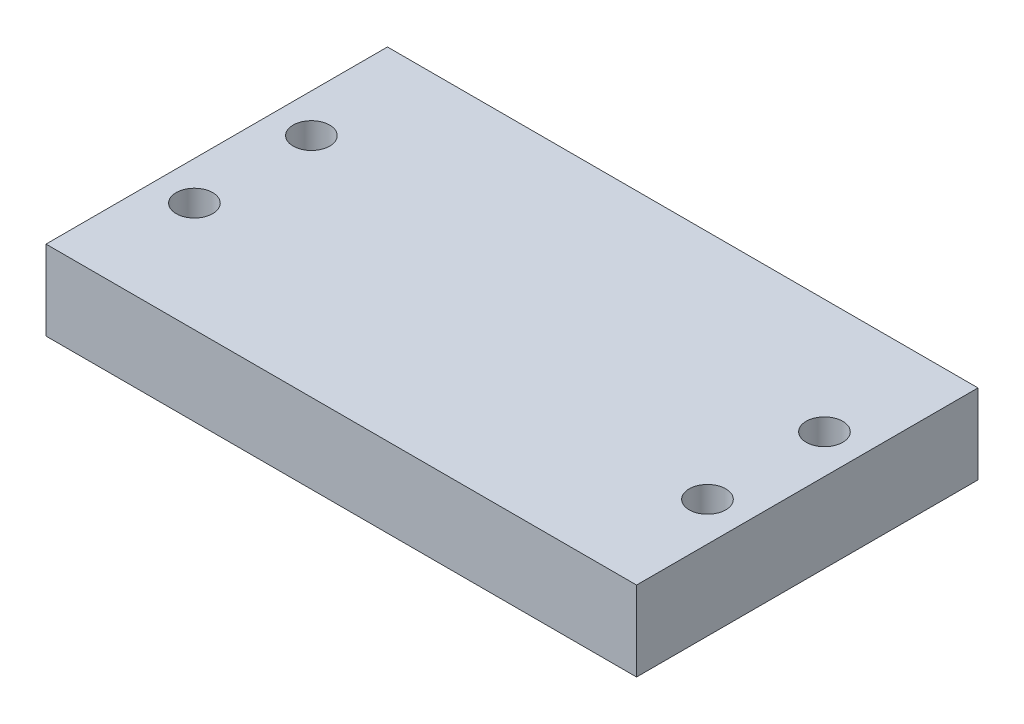
ISO-10303-21;
HEADER;
FILE_DESCRIPTION(('STEP AP214'),'2;1');
FILE_NAME('part.step','',(''),(''),'','','');
FILE_SCHEMA(('AUTOMOTIVE_DESIGN { 1 0 10303 214 1 1 1 1 }'));
ENDSEC;
DATA;
#1=APPLICATION_CONTEXT('core data for automotive mechanical design processes');
#2=APPLICATION_PROTOCOL_DEFINITION('international standard','automotive_design',2000,#1);
#3=PRODUCT_CONTEXT('',#1,'mechanical');
#4=PRODUCT('Part','Part','',(#3));
#5=PRODUCT_RELATED_PRODUCT_CATEGORY('part','',(#4));
#6=PRODUCT_DEFINITION_FORMATION('','',#4);
#7=PRODUCT_DEFINITION_CONTEXT('part definition',#1,'design');
#8=PRODUCT_DEFINITION('design','',#6,#7);
#9=PRODUCT_DEFINITION_SHAPE('','',#8);
#10=(LENGTH_UNIT() NAMED_UNIT(*) SI_UNIT(.MILLI.,.METRE.));
#11=(NAMED_UNIT(*) PLANE_ANGLE_UNIT() SI_UNIT($,.RADIAN.));
#12=(NAMED_UNIT(*) SI_UNIT($,.STERADIAN.) SOLID_ANGLE_UNIT());
#13=UNCERTAINTY_MEASURE_WITH_UNIT(LENGTH_MEASURE(1.E-05),#10,'distance_accuracy_value','');
#14=(GEOMETRIC_REPRESENTATION_CONTEXT(3) GLOBAL_UNCERTAINTY_ASSIGNED_CONTEXT((#13)) GLOBAL_UNIT_ASSIGNED_CONTEXT((#10,
#11,#12)) REPRESENTATION_CONTEXT('',''));
#15=CARTESIAN_POINT('',(0.,0.,0.));
#16=DIRECTION('',(0.,0.,1.));
#17=DIRECTION('',(1.,0.,0.));
#18=AXIS2_PLACEMENT_3D('',#15,#16,#17);
#19=CARTESIAN_POINT('',(-8.5935738283006,39.6881324662298,43.1588006735718));
#20=DIRECTION('',(1.,0.,0.));
#21=DIRECTION('',(0.,0.,-1.));
#22=AXIS2_PLACEMENT_3D('',#19,#20,#21);
#23=PLANE('',#22);
#24=DIRECTION('',(0.,0.,1.));
#25=VECTOR('',#24,1.);
#26=CARTESIAN_POINT('',(-8.5935738283006,28.7881324662298,43.1588006735718));
#27=LINE('',#26,#25);
#28=CARTESIAN_POINT('',(-8.5935738283006,28.7881324662298,43.1588006735718));
#29=VERTEX_POINT('',#28);
#30=CARTESIAN_POINT('',(-8.59357382830058,28.7881324662298,89.8588006735718));
#31=VERTEX_POINT('',#30);
#32=EDGE_CURVE('E79',#29,#31,#27,.T.);
#33=ORIENTED_EDGE('',*,*,#32,.T.);
#34=DIRECTION('',(0.,-1.,0.));
#35=VECTOR('',#34,1.);
#36=CARTESIAN_POINT('',(-8.59357382830058,39.6881324662298,89.8588006735718));
#37=LINE('',#36,#35);
#38=CARTESIAN_POINT('',(-8.59357382830058,39.6881324662298,89.8588006735718));
#39=VERTEX_POINT('',#38);
#40=EDGE_CURVE('E10',#39,#31,#37,.T.);
#41=ORIENTED_EDGE('',*,*,#40,.F.);
#42=DIRECTION('',(0.,0.,1.));
#43=VECTOR('',#42,1.);
#44=CARTESIAN_POINT('',(-8.5935738283006,39.6881324662298,43.1588006735718));
#45=LINE('',#44,#43);
#46=CARTESIAN_POINT('',(-8.5935738283006,39.6881324662298,43.1588006735718));
#47=VERTEX_POINT('',#46);
#48=EDGE_CURVE('E67',#47,#39,#45,.T.);
#49=ORIENTED_EDGE('',*,*,#48,.F.);
#50=DIRECTION('',(0.,-1.,0.));
#51=VECTOR('',#50,1.);
#52=CARTESIAN_POINT('',(-8.5935738283006,39.6881324662298,43.1588006735718));
#53=LINE('',#52,#51);
#54=EDGE_CURVE('E75',#47,#29,#53,.T.);
#55=ORIENTED_EDGE('',*,*,#54,.T.);
#56=EDGE_LOOP('',(#33,#41,#49,#55));
#57=FACE_BOUND('',#56,.T.);
#58=ADVANCED_FACE('F16',(#57),#23,.F.);
#59=CARTESIAN_POINT('',(-8.59357382830058,39.6881324662298,89.8588006735718));
#60=DIRECTION('',(0.,0.,-1.));
#61=DIRECTION('',(-1.,0.,0.));
#62=AXIS2_PLACEMENT_3D('',#59,#60,#61);
#63=PLANE('',#62);
#64=DIRECTION('',(1.,0.,0.));
#65=VECTOR('',#64,1.);
#66=CARTESIAN_POINT('',(-8.59357382830058,28.7881324662298,89.8588006735718));
#67=LINE('',#66,#65);
#68=CARTESIAN_POINT('',(72.1784261716994,28.7881324662298,89.8588006735718));
#69=VERTEX_POINT('',#68);
#70=EDGE_CURVE('E71',#31,#69,#67,.T.);
#71=ORIENTED_EDGE('',*,*,#70,.T.);
#72=DIRECTION('',(0.,-1.,0.));
#73=VECTOR('',#72,1.);
#74=CARTESIAN_POINT('',(72.1784261716994,39.6881324662298,89.8588006735718));
#75=LINE('',#74,#73);
#76=CARTESIAN_POINT('',(72.1784261716994,39.6881324662298,89.8588006735718));
#77=VERTEX_POINT('',#76);
#78=EDGE_CURVE('E24',#77,#69,#75,.T.);
#79=ORIENTED_EDGE('',*,*,#78,.F.);
#80=DIRECTION('',(1.,0.,0.));
#81=VECTOR('',#80,1.);
#82=CARTESIAN_POINT('',(-8.59357382830058,39.6881324662298,89.8588006735718));
#83=LINE('',#82,#81);
#84=EDGE_CURVE('E62',#39,#77,#83,.T.);
#85=ORIENTED_EDGE('',*,*,#84,.F.);
#86=ORIENTED_EDGE('',*,*,#40,.T.);
#87=EDGE_LOOP('',(#71,#79,#85,#86));
#88=FACE_BOUND('',#87,.T.);
#89=ADVANCED_FACE('F70',(#88),#63,.F.);
#90=CARTESIAN_POINT('',(72.1784261716994,39.6881324662298,43.1588006735718));
#91=DIRECTION('',(-1.,0.,0.));
#92=DIRECTION('',(0.,0.,1.));
#93=AXIS2_PLACEMENT_3D('',#90,#91,#92);
#94=PLANE('',#93);
#95=DIRECTION('',(0.,0.,-1.));
#96=VECTOR('',#95,1.);
#97=CARTESIAN_POINT('',(72.1784261716994,28.7881324662298,43.1588006735718));
#98=LINE('',#97,#96);
#99=CARTESIAN_POINT('',(72.1784261716994,28.7881324662298,43.1588006735718));
#100=VERTEX_POINT('',#99);
#101=EDGE_CURVE('E49',#69,#100,#98,.T.);
#102=ORIENTED_EDGE('',*,*,#101,.T.);
#103=DIRECTION('',(0.,-1.,0.));
#104=VECTOR('',#103,1.);
#105=CARTESIAN_POINT('',(72.1784261716994,39.6881324662298,43.1588006735718));
#106=LINE('',#105,#104);
#107=CARTESIAN_POINT('',(72.1784261716994,39.6881324662298,43.1588006735718));
#108=VERTEX_POINT('',#107);
#109=EDGE_CURVE('E72',#108,#100,#106,.T.);
#110=ORIENTED_EDGE('',*,*,#109,.F.);
#111=DIRECTION('',(0.,0.,-1.));
#112=VECTOR('',#111,1.);
#113=CARTESIAN_POINT('',(72.1784261716994,39.6881324662298,43.1588006735718));
#114=LINE('',#113,#112);
#115=EDGE_CURVE('E65',#77,#108,#114,.T.);
#116=ORIENTED_EDGE('',*,*,#115,.F.);
#117=ORIENTED_EDGE('',*,*,#78,.T.);
#118=EDGE_LOOP('',(#102,#110,#116,#117));
#119=FACE_BOUND('',#118,.T.);
#120=ADVANCED_FACE('F73',(#119),#94,.F.);
#121=CARTESIAN_POINT('',(-8.5935738283006,39.6881324662298,43.1588006735718));
#122=DIRECTION('',(0.,0.,1.));
#123=DIRECTION('',(1.,0.,0.));
#124=AXIS2_PLACEMENT_3D('',#121,#122,#123);
#125=PLANE('',#124);
#126=DIRECTION('',(-1.,0.,0.));
#127=VECTOR('',#126,1.);
#128=CARTESIAN_POINT('',(-8.5935738283006,28.7881324662298,43.1588006735718));
#129=LINE('',#128,#127);
#130=EDGE_CURVE('E55',#100,#29,#129,.T.);
#131=ORIENTED_EDGE('',*,*,#130,.T.);
#132=ORIENTED_EDGE('',*,*,#54,.F.);
#133=DIRECTION('',(-1.,0.,0.));
#134=VECTOR('',#133,1.);
#135=CARTESIAN_POINT('',(-8.5935738283006,39.6881324662298,43.1588006735718));
#136=LINE('',#135,#134);
#137=EDGE_CURVE('E32',#108,#47,#136,.T.);
#138=ORIENTED_EDGE('',*,*,#137,.F.);
#139=ORIENTED_EDGE('',*,*,#109,.T.);
#140=EDGE_LOOP('',(#131,#132,#138,#139));
#141=FACE_BOUND('',#140,.T.);
#142=ADVANCED_FACE('F87',(#141),#125,.F.);
#143=CARTESIAN_POINT('',(22.802735788802,39.6881324662298,36.122563537552));
#144=DIRECTION('',(0.,1.,0.));
#145=DIRECTION('',(0.,0.,1.));
#146=AXIS2_PLACEMENT_3D('',#143,#144,#145);
#147=PLANE('',#146);
#148=CARTESIAN_POINT('',(-3.29357382830061,39.6881324662298,58.8588006735718));
#149=DIRECTION('',(0.,1.,0.));
#150=DIRECTION('',(0.,0.,1.));
#151=AXIS2_PLACEMENT_3D('',#148,#149,#150);
#152=CIRCLE('',#151,2.49999999999999);
#153=CARTESIAN_POINT('',(-3.29357382830061,39.6881324662298,61.3588006735717));
#154=VERTEX_POINT('',#153);
#155=EDGE_CURVE('E113',#154,#154,#152,.T.);
#156=ORIENTED_EDGE('',*,*,#155,.F.);
#157=EDGE_LOOP('',(#156));
#158=FACE_BOUND('',#157,.T.);
#159=CARTESIAN_POINT('',(-3.2935738283006,39.6881324662298,74.8588006735717));
#160=DIRECTION('',(0.,1.,0.));
#161=DIRECTION('',(0.,0.,1.));
#162=AXIS2_PLACEMENT_3D('',#159,#160,#161);
#163=CIRCLE('',#162,2.49999999999999);
#164=CARTESIAN_POINT('',(-3.2935738283006,39.6881324662298,77.3588006735717));
#165=VERTEX_POINT('',#164);
#166=EDGE_CURVE('E107',#165,#165,#163,.T.);
#167=ORIENTED_EDGE('',*,*,#166,.F.);
#168=EDGE_LOOP('',(#167));
#169=FACE_BOUND('',#168,.T.);
#170=CARTESIAN_POINT('',(66.8784261716994,39.6881324662298,74.8588006735717));
#171=DIRECTION('',(0.,1.,0.));
#172=DIRECTION('',(0.,0.,1.));
#173=AXIS2_PLACEMENT_3D('',#170,#171,#172);
#174=CIRCLE('',#173,2.49999999999999);
#175=CARTESIAN_POINT('',(66.8784261716994,39.6881324662298,77.3588006735717));
#176=VERTEX_POINT('',#175);
#177=EDGE_CURVE('E101',#176,#176,#174,.T.);
#178=ORIENTED_EDGE('',*,*,#177,.F.);
#179=EDGE_LOOP('',(#178));
#180=FACE_BOUND('',#179,.T.);
#181=CARTESIAN_POINT('',(66.8784261716994,39.6881324662298,58.8588006735718));
#182=DIRECTION('',(0.,1.,0.));
#183=DIRECTION('',(0.,0.,1.));
#184=AXIS2_PLACEMENT_3D('',#181,#182,#183);
#185=CIRCLE('',#184,2.49999999999999);
#186=CARTESIAN_POINT('',(66.8784261716994,39.6881324662298,61.3588006735717));
#187=VERTEX_POINT('',#186);
#188=EDGE_CURVE('E95',#187,#187,#185,.T.);
#189=ORIENTED_EDGE('',*,*,#188,.F.);
#190=EDGE_LOOP('',(#189));
#191=FACE_BOUND('',#190,.T.);
#192=ORIENTED_EDGE('',*,*,#48,.T.);
#193=ORIENTED_EDGE('',*,*,#84,.T.);
#194=ORIENTED_EDGE('',*,*,#115,.T.);
#195=ORIENTED_EDGE('',*,*,#137,.T.);
#196=EDGE_LOOP('',(#192,#193,#194,#195));
#197=FACE_BOUND('',#196,.T.);
#198=ADVANCED_FACE('F63',(#158,#169,#180,#191,#197),#147,.T.);
#199=CARTESIAN_POINT('',(22.802735788802,28.7881324662298,36.122563537552));
#200=DIRECTION('',(0.,1.,0.));
#201=DIRECTION('',(0.,0.,1.));
#202=AXIS2_PLACEMENT_3D('',#199,#200,#201);
#203=PLANE('',#202);
#204=CARTESIAN_POINT('',(-3.29357382830061,28.7881324662298,58.8588006735718));
#205=DIRECTION('',(0.,1.,0.));
#206=DIRECTION('',(0.,0.,1.));
#207=AXIS2_PLACEMENT_3D('',#204,#205,#206);
#208=CIRCLE('',#207,2.5);
#209=CARTESIAN_POINT('',(-3.29357382830061,28.7881324662298,61.3588006735717));
#210=VERTEX_POINT('',#209);
#211=EDGE_CURVE('E110',#210,#210,#208,.T.);
#212=ORIENTED_EDGE('',*,*,#211,.T.);
#213=EDGE_LOOP('',(#212));
#214=FACE_BOUND('',#213,.T.);
#215=CARTESIAN_POINT('',(-3.2935738283006,28.7881324662298,74.8588006735717));
#216=DIRECTION('',(0.,1.,0.));
#217=DIRECTION('',(0.,0.,1.));
#218=AXIS2_PLACEMENT_3D('',#215,#216,#217);
#219=CIRCLE('',#218,2.5);
#220=CARTESIAN_POINT('',(-3.2935738283006,28.7881324662298,77.3588006735718));
#221=VERTEX_POINT('',#220);
#222=EDGE_CURVE('E104',#221,#221,#219,.T.);
#223=ORIENTED_EDGE('',*,*,#222,.T.);
#224=EDGE_LOOP('',(#223));
#225=FACE_BOUND('',#224,.T.);
#226=CARTESIAN_POINT('',(66.8784261716994,28.7881324662298,74.8588006735717));
#227=DIRECTION('',(0.,1.,0.));
#228=DIRECTION('',(0.,0.,1.));
#229=AXIS2_PLACEMENT_3D('',#226,#227,#228);
#230=CIRCLE('',#229,2.5);
#231=CARTESIAN_POINT('',(66.8784261716994,28.7881324662298,77.3588006735718));
#232=VERTEX_POINT('',#231);
#233=EDGE_CURVE('E98',#232,#232,#230,.T.);
#234=ORIENTED_EDGE('',*,*,#233,.T.);
#235=EDGE_LOOP('',(#234));
#236=FACE_BOUND('',#235,.T.);
#237=CARTESIAN_POINT('',(66.8784261716994,28.7881324662298,58.8588006735718));
#238=DIRECTION('',(0.,1.,0.));
#239=DIRECTION('',(0.,0.,1.));
#240=AXIS2_PLACEMENT_3D('',#237,#238,#239);
#241=CIRCLE('',#240,2.5);
#242=CARTESIAN_POINT('',(66.8784261716994,28.7881324662298,61.3588006735718));
#243=VERTEX_POINT('',#242);
#244=EDGE_CURVE('E82',#243,#243,#241,.T.);
#245=ORIENTED_EDGE('',*,*,#244,.T.);
#246=EDGE_LOOP('',(#245));
#247=FACE_BOUND('',#246,.T.);
#248=ORIENTED_EDGE('',*,*,#32,.F.);
#249=ORIENTED_EDGE('',*,*,#130,.F.);
#250=ORIENTED_EDGE('',*,*,#101,.F.);
#251=ORIENTED_EDGE('',*,*,#70,.F.);
#252=EDGE_LOOP('',(#248,#249,#250,#251));
#253=FACE_BOUND('',#252,.T.);
#254=ADVANCED_FACE('F90',(#214,#225,#236,#247,#253),#203,.F.);
#255=CARTESIAN_POINT('',(66.8784261716994,39.6881324662298,58.8588006735718));
#256=DIRECTION('',(0.,1.,0.));
#257=DIRECTION('',(0.,0.,1.));
#258=AXIS2_PLACEMENT_3D('',#255,#256,#257);
#259=CYLINDRICAL_SURFACE('',#258,2.5);
#260=ORIENTED_EDGE('',*,*,#244,.F.);
#261=EDGE_LOOP('',(#260));
#262=FACE_BOUND('',#261,.T.);
#263=ORIENTED_EDGE('',*,*,#188,.T.);
#264=EDGE_LOOP('',(#263));
#265=FACE_BOUND('',#264,.T.);
#266=ADVANCED_FACE('F128',(#262,#265),#259,.F.);
#267=CARTESIAN_POINT('',(66.8784261716994,39.6881324662298,74.8588006735717));
#268=DIRECTION('',(0.,1.,0.));
#269=DIRECTION('',(0.,0.,1.));
#270=AXIS2_PLACEMENT_3D('',#267,#268,#269);
#271=CYLINDRICAL_SURFACE('',#270,2.5);
#272=ORIENTED_EDGE('',*,*,#233,.F.);
#273=EDGE_LOOP('',(#272));
#274=FACE_BOUND('',#273,.T.);
#275=ORIENTED_EDGE('',*,*,#177,.T.);
#276=EDGE_LOOP('',(#275));
#277=FACE_BOUND('',#276,.T.);
#278=ADVANCED_FACE('F130',(#274,#277),#271,.F.);
#279=CARTESIAN_POINT('',(-3.2935738283006,39.6881324662298,74.8588006735717));
#280=DIRECTION('',(0.,1.,0.));
#281=DIRECTION('',(0.,0.,1.));
#282=AXIS2_PLACEMENT_3D('',#279,#280,#281);
#283=CYLINDRICAL_SURFACE('',#282,2.49999999999999);
#284=ORIENTED_EDGE('',*,*,#222,.F.);
#285=EDGE_LOOP('',(#284));
#286=FACE_BOUND('',#285,.T.);
#287=ORIENTED_EDGE('',*,*,#166,.T.);
#288=EDGE_LOOP('',(#287));
#289=FACE_BOUND('',#288,.T.);
#290=ADVANCED_FACE('F138',(#286,#289),#283,.F.);
#291=CARTESIAN_POINT('',(-3.29357382830061,39.6881324662298,58.8588006735718));
#292=DIRECTION('',(0.,1.,0.));
#293=DIRECTION('',(0.,0.,1.));
#294=AXIS2_PLACEMENT_3D('',#291,#292,#293);
#295=CYLINDRICAL_SURFACE('',#294,2.49999999999999);
#296=ORIENTED_EDGE('',*,*,#211,.F.);
#297=EDGE_LOOP('',(#296));
#298=FACE_BOUND('',#297,.T.);
#299=ORIENTED_EDGE('',*,*,#155,.T.);
#300=EDGE_LOOP('',(#299));
#301=FACE_BOUND('',#300,.T.);
#302=ADVANCED_FACE('F117',(#298,#301),#295,.F.);
#303=CLOSED_SHELL('',(#58,#89,#120,#142,#198,#254,#266,#278,#290,#302));
#304=MANIFOLD_SOLID_BREP('B1',#303);
#305=ADVANCED_BREP_SHAPE_REPRESENTATION('',(#18,#304),#14);
#306=SHAPE_DEFINITION_REPRESENTATION(#9,#305);
ENDSEC;
END-ISO-10303-21;
